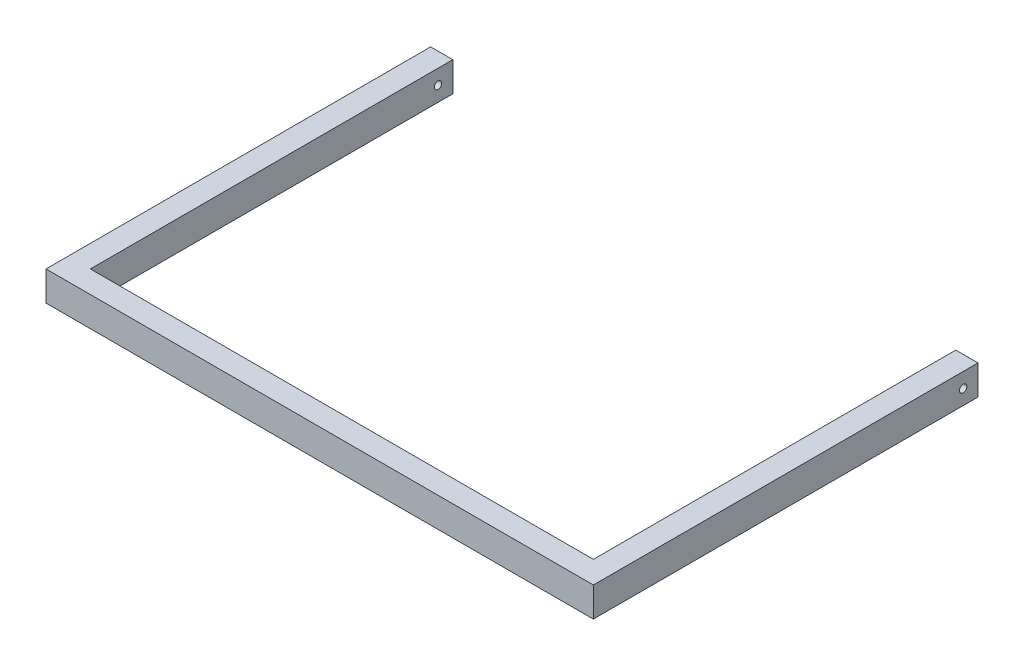
ISO-10303-21;
HEADER;
FILE_DESCRIPTION(('STEP AP214'),'2;1');
FILE_NAME('part.step','',(''),(''),'','','');
FILE_SCHEMA(('AUTOMOTIVE_DESIGN { 1 0 10303 214 1 1 1 1 }'));
ENDSEC;
DATA;
#1=APPLICATION_CONTEXT('core data for automotive mechanical design processes');
#2=APPLICATION_PROTOCOL_DEFINITION('international standard','automotive_design',2000,#1);
#3=PRODUCT_CONTEXT('',#1,'mechanical');
#4=PRODUCT('Part','Part','',(#3));
#5=PRODUCT_RELATED_PRODUCT_CATEGORY('part','',(#4));
#6=PRODUCT_DEFINITION_FORMATION('','',#4);
#7=PRODUCT_DEFINITION_CONTEXT('part definition',#1,'design');
#8=PRODUCT_DEFINITION('design','',#6,#7);
#9=PRODUCT_DEFINITION_SHAPE('','',#8);
#10=(LENGTH_UNIT() NAMED_UNIT(*) SI_UNIT(.MILLI.,.METRE.));
#11=(NAMED_UNIT(*) PLANE_ANGLE_UNIT() SI_UNIT($,.RADIAN.));
#12=(NAMED_UNIT(*) SI_UNIT($,.STERADIAN.) SOLID_ANGLE_UNIT());
#13=UNCERTAINTY_MEASURE_WITH_UNIT(LENGTH_MEASURE(1.E-05),#10,'distance_accuracy_value','');
#14=(GEOMETRIC_REPRESENTATION_CONTEXT(3) GLOBAL_UNCERTAINTY_ASSIGNED_CONTEXT((#13)) GLOBAL_UNIT_ASSIGNED_CONTEXT((#10,
#11,#12)) REPRESENTATION_CONTEXT('',''));
#15=CARTESIAN_POINT('',(0.,0.,0.));
#16=DIRECTION('',(0.,0.,1.));
#17=DIRECTION('',(1.,0.,0.));
#18=AXIS2_PLACEMENT_3D('',#15,#16,#17);
#19=CARTESIAN_POINT('',(-28.4675803722504,40.,-486.843020924661));
#20=DIRECTION('',(0.,0.,1.));
#21=DIRECTION('',(1.,0.,0.));
#22=AXIS2_PLACEMENT_3D('',#19,#20,#21);
#23=PLANE('',#22);
#24=DIRECTION('',(-1.,0.,0.));
#25=VECTOR('',#24,1.);
#26=CARTESIAN_POINT('',(-28.4675803722504,0.,-486.843020924661));
#27=LINE('',#26,#25);
#28=CARTESIAN_POINT('',(1.53241962774955,0.,-486.843020924661));
#29=VERTEX_POINT('',#28);
#30=CARTESIAN_POINT('',(-28.4675803722504,0.,-486.843020924661));
#31=VERTEX_POINT('',#30);
#32=EDGE_CURVE('E132',#29,#31,#27,.T.);
#33=ORIENTED_EDGE('',*,*,#32,.T.);
#34=DIRECTION('',(0.,-1.,0.));
#35=VECTOR('',#34,1.);
#36=CARTESIAN_POINT('',(-28.4675803722504,40.,-486.843020924661));
#37=LINE('',#36,#35);
#38=CARTESIAN_POINT('',(-28.4675803722504,40.,-486.843020924661));
#39=VERTEX_POINT('',#38);
#40=EDGE_CURVE('E11',#39,#31,#37,.T.);
#41=ORIENTED_EDGE('',*,*,#40,.F.);
#42=DIRECTION('',(-1.,0.,0.));
#43=VECTOR('',#42,1.);
#44=CARTESIAN_POINT('',(-28.4675803722504,40.,-486.843020924661));
#45=LINE('',#44,#43);
#46=CARTESIAN_POINT('',(1.53241962774955,40.,-486.843020924661));
#47=VERTEX_POINT('',#46);
#48=EDGE_CURVE('E147',#47,#39,#45,.T.);
#49=ORIENTED_EDGE('',*,*,#48,.F.);
#50=DIRECTION('',(0.,-1.,0.));
#51=VECTOR('',#50,1.);
#52=CARTESIAN_POINT('',(1.53241962774955,40.,-486.843020924661));
#53=LINE('',#52,#51);
#54=EDGE_CURVE('E128',#47,#29,#53,.T.);
#55=ORIENTED_EDGE('',*,*,#54,.T.);
#56=EDGE_LOOP('',(#33,#41,#49,#55));
#57=FACE_BOUND('',#56,.T.);
#58=ADVANCED_FACE('F35',(#57),#23,.F.);
#59=CARTESIAN_POINT('',(-28.4675803722504,40.,-486.843020924661));
#60=DIRECTION('',(1.,0.,0.));
#61=DIRECTION('',(0.,0.,-1.));
#62=AXIS2_PLACEMENT_3D('',#59,#60,#61);
#63=PLANE('',#62);
#64=CARTESIAN_POINT('',(-28.4675803722505,20.0000000000002,-466.84302092466));
#65=DIRECTION('',(1.,0.,0.));
#66=DIRECTION('',(0.,0.,-1.));
#67=AXIS2_PLACEMENT_3D('',#64,#65,#66);
#68=CIRCLE('',#67,5.00000000000005);
#69=CARTESIAN_POINT('',(-28.4675803722505,20.0000000000002,-471.84302092466));
#70=VERTEX_POINT('',#69);
#71=EDGE_CURVE('E186',#70,#70,#68,.T.);
#72=ORIENTED_EDGE('',*,*,#71,.T.);
#73=EDGE_LOOP('',(#72));
#74=FACE_BOUND('',#73,.T.);
#75=DIRECTION('',(0.,0.,1.));
#76=VECTOR('',#75,1.);
#77=CARTESIAN_POINT('',(-28.4675803722504,0.,-486.843020924661));
#78=LINE('',#77,#76);
#79=CARTESIAN_POINT('',(-28.4675803722504,0.,33.1569790753393));
#80=VERTEX_POINT('',#79);
#81=EDGE_CURVE('E135',#31,#80,#78,.T.);
#82=ORIENTED_EDGE('',*,*,#81,.T.);
#83=DIRECTION('',(0.,-1.,0.));
#84=VECTOR('',#83,1.);
#85=CARTESIAN_POINT('',(-28.4675803722504,40.,33.1569790753393));
#86=LINE('',#85,#84);
#87=CARTESIAN_POINT('',(-28.4675803722504,40.,33.1569790753393));
#88=VERTEX_POINT('',#87);
#89=EDGE_CURVE('E44',#88,#80,#86,.T.);
#90=ORIENTED_EDGE('',*,*,#89,.F.);
#91=DIRECTION('',(0.,0.,1.));
#92=VECTOR('',#91,1.);
#93=CARTESIAN_POINT('',(-28.4675803722504,40.,-486.843020924661));
#94=LINE('',#93,#92);
#95=EDGE_CURVE('E95',#39,#88,#94,.T.);
#96=ORIENTED_EDGE('',*,*,#95,.F.);
#97=ORIENTED_EDGE('',*,*,#40,.T.);
#98=EDGE_LOOP('',(#82,#90,#96,#97));
#99=FACE_BOUND('',#98,.T.);
#100=ADVANCED_FACE('F208',(#74,#99),#63,.F.);
#101=CARTESIAN_POINT('',(-28.4675803722504,40.,33.1569790753393));
#102=DIRECTION('',(0.,0.,-1.));
#103=DIRECTION('',(-1.,0.,0.));
#104=AXIS2_PLACEMENT_3D('',#101,#102,#103);
#105=PLANE('',#104);
#106=DIRECTION('',(1.,0.,0.));
#107=VECTOR('',#106,1.);
#108=CARTESIAN_POINT('',(-28.4675803722504,0.,33.1569790753393));
#109=LINE('',#108,#107);
#110=CARTESIAN_POINT('',(711.53241962775,0.,33.1569790753393));
#111=VERTEX_POINT('',#110);
#112=EDGE_CURVE('E138',#80,#111,#109,.T.);
#113=ORIENTED_EDGE('',*,*,#112,.T.);
#114=DIRECTION('',(0.,-1.,0.));
#115=VECTOR('',#114,1.);
#116=CARTESIAN_POINT('',(711.53241962775,40.,33.1569790753393));
#117=LINE('',#116,#115);
#118=CARTESIAN_POINT('',(711.53241962775,40.,33.1569790753393));
#119=VERTEX_POINT('',#118);
#120=EDGE_CURVE('E154',#119,#111,#117,.T.);
#121=ORIENTED_EDGE('',*,*,#120,.F.);
#122=DIRECTION('',(1.,0.,0.));
#123=VECTOR('',#122,1.);
#124=CARTESIAN_POINT('',(-28.4675803722504,40.,33.1569790753393));
#125=LINE('',#124,#123);
#126=EDGE_CURVE('E163',#88,#119,#125,.T.);
#127=ORIENTED_EDGE('',*,*,#126,.F.);
#128=ORIENTED_EDGE('',*,*,#89,.T.);
#129=EDGE_LOOP('',(#113,#121,#127,#128));
#130=FACE_BOUND('',#129,.T.);
#131=ADVANCED_FACE('F161',(#130),#105,.F.);
#132=CARTESIAN_POINT('',(711.53241962775,40.,33.1569790753393));
#133=DIRECTION('',(-1.,0.,0.));
#134=DIRECTION('',(0.,0.,1.));
#135=AXIS2_PLACEMENT_3D('',#132,#133,#134);
#136=PLANE('',#135);
#137=CARTESIAN_POINT('',(711.53241962775,20.0000000000002,-466.84302092466));
#138=DIRECTION('',(1.,0.,0.));
#139=DIRECTION('',(0.,0.,-1.));
#140=AXIS2_PLACEMENT_3D('',#137,#138,#139);
#141=CIRCLE('',#140,5.00000000000005);
#142=CARTESIAN_POINT('',(711.53241962775,20.0000000000002,-471.84302092466));
#143=VERTEX_POINT('',#142);
#144=EDGE_CURVE('E183',#143,#143,#141,.T.);
#145=ORIENTED_EDGE('',*,*,#144,.F.);
#146=EDGE_LOOP('',(#145));
#147=FACE_BOUND('',#146,.T.);
#148=DIRECTION('',(0.,0.,-1.));
#149=VECTOR('',#148,1.);
#150=CARTESIAN_POINT('',(711.53241962775,0.,33.1569790753393));
#151=LINE('',#150,#149);
#152=CARTESIAN_POINT('',(711.53241962775,0.,-486.843020924661));
#153=VERTEX_POINT('',#152);
#154=EDGE_CURVE('E140',#111,#153,#151,.T.);
#155=ORIENTED_EDGE('',*,*,#154,.T.);
#156=DIRECTION('',(0.,-1.,0.));
#157=VECTOR('',#156,1.);
#158=CARTESIAN_POINT('',(711.53241962775,40.,-486.843020924661));
#159=LINE('',#158,#157);
#160=CARTESIAN_POINT('',(711.53241962775,40.,-486.843020924661));
#161=VERTEX_POINT('',#160);
#162=EDGE_CURVE('E151',#161,#153,#159,.T.);
#163=ORIENTED_EDGE('',*,*,#162,.F.);
#164=DIRECTION('',(0.,0.,-1.));
#165=VECTOR('',#164,1.);
#166=CARTESIAN_POINT('',(711.53241962775,40.,33.1569790753393));
#167=LINE('',#166,#165);
#168=EDGE_CURVE('E175',#119,#161,#167,.T.);
#169=ORIENTED_EDGE('',*,*,#168,.F.);
#170=ORIENTED_EDGE('',*,*,#120,.T.);
#171=EDGE_LOOP('',(#155,#163,#169,#170));
#172=FACE_BOUND('',#171,.T.);
#173=ADVANCED_FACE('F171',(#147,#172),#136,.F.);
#174=CARTESIAN_POINT('',(711.53241962775,40.,-486.843020924661));
#175=DIRECTION('',(0.,0.,1.));
#176=DIRECTION('',(1.,0.,0.));
#177=AXIS2_PLACEMENT_3D('',#174,#175,#176);
#178=PLANE('',#177);
#179=DIRECTION('',(-1.,0.,0.));
#180=VECTOR('',#179,1.);
#181=CARTESIAN_POINT('',(711.53241962775,0.,-486.843020924661));
#182=LINE('',#181,#180);
#183=CARTESIAN_POINT('',(681.53241962775,0.,-486.843020924661));
#184=VERTEX_POINT('',#183);
#185=EDGE_CURVE('E142',#153,#184,#182,.T.);
#186=ORIENTED_EDGE('',*,*,#185,.T.);
#187=DIRECTION('',(0.,-1.,0.));
#188=VECTOR('',#187,1.);
#189=CARTESIAN_POINT('',(681.53241962775,40.,-486.843020924661));
#190=LINE('',#189,#188);
#191=CARTESIAN_POINT('',(681.53241962775,40.,-486.843020924661));
#192=VERTEX_POINT('',#191);
#193=EDGE_CURVE('E123',#192,#184,#190,.T.);
#194=ORIENTED_EDGE('',*,*,#193,.F.);
#195=DIRECTION('',(-1.,0.,0.));
#196=VECTOR('',#195,1.);
#197=CARTESIAN_POINT('',(711.53241962775,40.,-486.843020924661));
#198=LINE('',#197,#196);
#199=EDGE_CURVE('E114',#161,#192,#198,.T.);
#200=ORIENTED_EDGE('',*,*,#199,.F.);
#201=ORIENTED_EDGE('',*,*,#162,.T.);
#202=EDGE_LOOP('',(#186,#194,#200,#201));
#203=FACE_BOUND('',#202,.T.);
#204=ADVANCED_FACE('F174',(#203),#178,.F.);
#205=CARTESIAN_POINT('',(681.53241962775,40.,3.15697907533925));
#206=DIRECTION('',(1.,0.,0.));
#207=DIRECTION('',(0.,0.,-1.));
#208=AXIS2_PLACEMENT_3D('',#205,#206,#207);
#209=PLANE('',#208);
#210=CARTESIAN_POINT('',(681.53241962775,20.0000000000002,-466.84302092466));
#211=DIRECTION('',(1.,0.,0.));
#212=DIRECTION('',(0.,0.,-1.));
#213=AXIS2_PLACEMENT_3D('',#210,#211,#212);
#214=CIRCLE('',#213,5.00000000000005);
#215=CARTESIAN_POINT('',(681.53241962775,20.0000000000002,-471.84302092466));
#216=VERTEX_POINT('',#215);
#217=EDGE_CURVE('E136',#216,#216,#214,.T.);
#218=ORIENTED_EDGE('',*,*,#217,.T.);
#219=EDGE_LOOP('',(#218));
#220=FACE_BOUND('',#219,.T.);
#221=DIRECTION('',(0.,0.,1.));
#222=VECTOR('',#221,1.);
#223=CARTESIAN_POINT('',(681.53241962775,0.,3.15697907533925));
#224=LINE('',#223,#222);
#225=CARTESIAN_POINT('',(681.53241962775,0.,3.15697907533925));
#226=VERTEX_POINT('',#225);
#227=EDGE_CURVE('E122',#184,#226,#224,.T.);
#228=ORIENTED_EDGE('',*,*,#227,.T.);
#229=DIRECTION('',(0.,-1.,0.));
#230=VECTOR('',#229,1.);
#231=CARTESIAN_POINT('',(681.53241962775,40.,3.15697907533925));
#232=LINE('',#231,#230);
#233=CARTESIAN_POINT('',(681.53241962775,40.,3.15697907533925));
#234=VERTEX_POINT('',#233);
#235=EDGE_CURVE('E119',#234,#226,#232,.T.);
#236=ORIENTED_EDGE('',*,*,#235,.F.);
#237=DIRECTION('',(0.,0.,1.));
#238=VECTOR('',#237,1.);
#239=CARTESIAN_POINT('',(681.53241962775,40.,3.15697907533925));
#240=LINE('',#239,#238);
#241=EDGE_CURVE('E108',#192,#234,#240,.T.);
#242=ORIENTED_EDGE('',*,*,#241,.F.);
#243=ORIENTED_EDGE('',*,*,#193,.T.);
#244=EDGE_LOOP('',(#228,#236,#242,#243));
#245=FACE_BOUND('',#244,.T.);
#246=ADVANCED_FACE('F120',(#220,#245),#209,.F.);
#247=CARTESIAN_POINT('',(1.53241962774961,40.,3.15697907533925));
#248=DIRECTION('',(0.,0.,1.));
#249=DIRECTION('',(1.,0.,0.));
#250=AXIS2_PLACEMENT_3D('',#247,#248,#249);
#251=PLANE('',#250);
#252=DIRECTION('',(-1.,0.,0.));
#253=VECTOR('',#252,1.);
#254=CARTESIAN_POINT('',(1.53241962774961,0.,3.15697907533925));
#255=LINE('',#254,#253);
#256=CARTESIAN_POINT('',(1.53241962774961,0.,3.15697907533925));
#257=VERTEX_POINT('',#256);
#258=EDGE_CURVE('E81',#226,#257,#255,.T.);
#259=ORIENTED_EDGE('',*,*,#258,.T.);
#260=DIRECTION('',(0.,-1.,0.));
#261=VECTOR('',#260,1.);
#262=CARTESIAN_POINT('',(1.53241962774961,40.,3.15697907533925));
#263=LINE('',#262,#261);
#264=CARTESIAN_POINT('',(1.53241962774961,40.,3.15697907533925));
#265=VERTEX_POINT('',#264);
#266=EDGE_CURVE('E124',#265,#257,#263,.T.);
#267=ORIENTED_EDGE('',*,*,#266,.F.);
#268=DIRECTION('',(-1.,0.,0.));
#269=VECTOR('',#268,1.);
#270=CARTESIAN_POINT('',(1.53241962774961,40.,3.15697907533925));
#271=LINE('',#270,#269);
#272=EDGE_CURVE('E112',#234,#265,#271,.T.);
#273=ORIENTED_EDGE('',*,*,#272,.F.);
#274=ORIENTED_EDGE('',*,*,#235,.T.);
#275=EDGE_LOOP('',(#259,#267,#273,#274));
#276=FACE_BOUND('',#275,.T.);
#277=ADVANCED_FACE('F126',(#276),#251,.F.);
#278=CARTESIAN_POINT('',(1.53241962774955,40.,-486.843020924661));
#279=DIRECTION('',(-1.,0.,0.));
#280=DIRECTION('',(0.,0.,1.));
#281=AXIS2_PLACEMENT_3D('',#278,#279,#280);
#282=PLANE('',#281);
#283=CARTESIAN_POINT('',(1.53241962774956,20.0000000000002,-466.84302092466));
#284=DIRECTION('',(-1.,0.,0.));
#285=DIRECTION('',(0.,0.,1.));
#286=AXIS2_PLACEMENT_3D('',#283,#284,#285);
#287=CIRCLE('',#286,5.00000000000005);
#288=CARTESIAN_POINT('',(1.53241962774956,20.0000000000002,-461.84302092466));
#289=VERTEX_POINT('',#288);
#290=EDGE_CURVE('E38',#289,#289,#287,.T.);
#291=ORIENTED_EDGE('',*,*,#290,.T.);
#292=EDGE_LOOP('',(#291));
#293=FACE_BOUND('',#292,.T.);
#294=DIRECTION('',(0.,0.,-1.));
#295=VECTOR('',#294,1.);
#296=CARTESIAN_POINT('',(1.53241962774955,0.,-486.843020924661));
#297=LINE('',#296,#295);
#298=EDGE_CURVE('E87',#257,#29,#297,.T.);
#299=ORIENTED_EDGE('',*,*,#298,.T.);
#300=ORIENTED_EDGE('',*,*,#54,.F.);
#301=DIRECTION('',(0.,0.,-1.));
#302=VECTOR('',#301,1.);
#303=CARTESIAN_POINT('',(1.53241962774955,40.,-486.843020924661));
#304=LINE('',#303,#302);
#305=EDGE_CURVE('E52',#265,#47,#304,.T.);
#306=ORIENTED_EDGE('',*,*,#305,.F.);
#307=ORIENTED_EDGE('',*,*,#266,.T.);
#308=EDGE_LOOP('',(#299,#300,#306,#307));
#309=FACE_BOUND('',#308,.T.);
#310=ADVANCED_FACE('F193',(#293,#309),#282,.F.);
#311=CARTESIAN_POINT('',(0.,40.,0.));
#312=DIRECTION('',(0.,-1.,0.));
#313=DIRECTION('',(0.,0.,-1.));
#314=AXIS2_PLACEMENT_3D('',#311,#312,#313);
#315=PLANE('',#314);
#316=ORIENTED_EDGE('',*,*,#48,.T.);
#317=ORIENTED_EDGE('',*,*,#95,.T.);
#318=ORIENTED_EDGE('',*,*,#126,.T.);
#319=ORIENTED_EDGE('',*,*,#168,.T.);
#320=ORIENTED_EDGE('',*,*,#199,.T.);
#321=ORIENTED_EDGE('',*,*,#241,.T.);
#322=ORIENTED_EDGE('',*,*,#272,.T.);
#323=ORIENTED_EDGE('',*,*,#305,.T.);
#324=EDGE_LOOP('',(#316,#317,#318,#319,#320,#321,#322,#323));
#325=FACE_BOUND('',#324,.T.);
#326=ADVANCED_FACE('F110',(#325),#315,.F.);
#327=CARTESIAN_POINT('',(0.,0.,0.));
#328=DIRECTION('',(0.,-1.,0.));
#329=DIRECTION('',(0.,0.,-1.));
#330=AXIS2_PLACEMENT_3D('',#327,#328,#329);
#331=PLANE('',#330);
#332=ORIENTED_EDGE('',*,*,#32,.F.);
#333=ORIENTED_EDGE('',*,*,#298,.F.);
#334=ORIENTED_EDGE('',*,*,#258,.F.);
#335=ORIENTED_EDGE('',*,*,#227,.F.);
#336=ORIENTED_EDGE('',*,*,#185,.F.);
#337=ORIENTED_EDGE('',*,*,#154,.F.);
#338=ORIENTED_EDGE('',*,*,#112,.F.);
#339=ORIENTED_EDGE('',*,*,#81,.F.);
#340=EDGE_LOOP('',(#332,#333,#334,#335,#336,#337,#338,#339));
#341=FACE_BOUND('',#340,.T.);
#342=ADVANCED_FACE('F167',(#341),#331,.T.);
#343=CARTESIAN_POINT('',(-28.4675803722505,20.0000000000002,-466.84302092466));
#344=DIRECTION('',(1.,0.,0.));
#345=DIRECTION('',(0.,0.,-1.));
#346=AXIS2_PLACEMENT_3D('',#343,#344,#345);
#347=CYLINDRICAL_SURFACE('',#346,5.00000000000005);
#348=ORIENTED_EDGE('',*,*,#71,.F.);
#349=EDGE_LOOP('',(#348));
#350=FACE_BOUND('',#349,.T.);
#351=ORIENTED_EDGE('',*,*,#290,.F.);
#352=EDGE_LOOP('',(#351));
#353=FACE_BOUND('',#352,.T.);
#354=ADVANCED_FACE('F195',(#350,#353),#347,.F.);
#355=ORIENTED_EDGE('',*,*,#144,.T.);
#356=EDGE_LOOP('',(#355));
#357=FACE_BOUND('',#356,.T.);
#358=ORIENTED_EDGE('',*,*,#217,.F.);
#359=EDGE_LOOP('',(#358));
#360=FACE_BOUND('',#359,.T.);
#361=ADVANCED_FACE('F197',(#357,#360),#347,.F.);
#362=CLOSED_SHELL('',(#58,#100,#131,#173,#204,#246,#277,#310,#326,#342,#354,#361));
#363=MANIFOLD_SOLID_BREP('B2',#362);
#364=ADVANCED_BREP_SHAPE_REPRESENTATION('',(#18,#363),#14);
#365=SHAPE_DEFINITION_REPRESENTATION(#9,#364);
ENDSEC;
END-ISO-10303-21;
